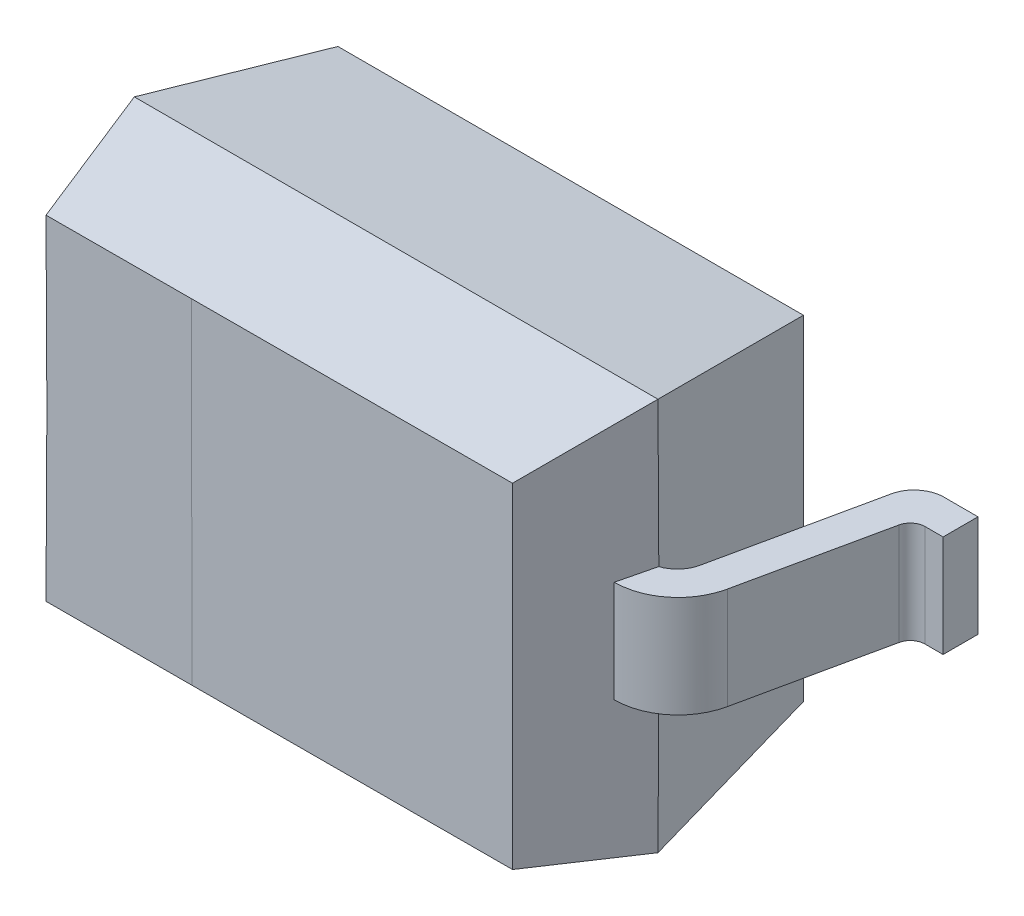
ISO-10303-21;
HEADER;
FILE_DESCRIPTION(('STEP AP214'),'2;1');
FILE_NAME('part.step','',(''),(''),'','','');
FILE_SCHEMA(('AUTOMOTIVE_DESIGN { 1 0 10303 214 1 1 1 1 }'));
ENDSEC;
DATA;
#1=APPLICATION_CONTEXT('core data for automotive mechanical design processes');
#2=APPLICATION_PROTOCOL_DEFINITION('international standard','automotive_design',2000,#1);
#3=PRODUCT_CONTEXT('',#1,'mechanical');
#4=PRODUCT('Part','Part','',(#3));
#5=PRODUCT_RELATED_PRODUCT_CATEGORY('part','',(#4));
#6=PRODUCT_DEFINITION_FORMATION('','',#4);
#7=PRODUCT_DEFINITION_CONTEXT('part definition',#1,'design');
#8=PRODUCT_DEFINITION('design','',#6,#7);
#9=PRODUCT_DEFINITION_SHAPE('','',#8);
#10=(LENGTH_UNIT() NAMED_UNIT(*) SI_UNIT(.MILLI.,.METRE.));
#11=(NAMED_UNIT(*) PLANE_ANGLE_UNIT() SI_UNIT($,.RADIAN.));
#12=(NAMED_UNIT(*) SI_UNIT($,.STERADIAN.) SOLID_ANGLE_UNIT());
#13=UNCERTAINTY_MEASURE_WITH_UNIT(LENGTH_MEASURE(1.E-05),#10,'distance_accuracy_value','');
#14=(GEOMETRIC_REPRESENTATION_CONTEXT(3) GLOBAL_UNCERTAINTY_ASSIGNED_CONTEXT((#13)) GLOBAL_UNIT_ASSIGNED_CONTEXT((#10,
#11,#12)) REPRESENTATION_CONTEXT('',''));
#15=CARTESIAN_POINT('',(0.,0.,0.));
#16=DIRECTION('',(0.,0.,1.));
#17=DIRECTION('',(1.,0.,0.));
#18=AXIS2_PLACEMENT_3D('',#15,#16,#17);
#19=CARTESIAN_POINT('',(0.,-0.543243243288,-0.09054054054794));
#20=DIRECTION('',(0.,0.986393923832198,0.164398987305033));
#21=DIRECTION('',(0.,-0.164398987305033,0.986393923832198));
#22=AXIS2_PLACEMENT_3D('',#19,#20,#21);
#23=PLANE('',#22);
#24=DIRECTION('',(1.,0.,0.));
#25=VECTOR('',#24,1.);
#26=CARTESIAN_POINT('',(0.,-0.575000000044785,0.0999999999931558));
#27=LINE('',#26,#25);
#28=CARTESIAN_POINT('',(0.799999999997001,-0.575000000043201,0.0999999999954373));
#29=VERTEX_POINT('',#28);
#30=CARTESIAN_POINT('',(-0.799999999994415,-0.575000000044785,0.0999999999954372));
#31=VERTEX_POINT('',#30);
#32=EDGE_CURVE('E193',#29,#31,#27,.F.);
#33=ORIENTED_EDGE('',*,*,#32,.F.);
#34=DIRECTION('',(-0.162221421362343,0.162221421124184,-0.973328526747075));
#35=VECTOR('',#34,1.);
#36=CARTESIAN_POINT('',(0.900000000150001,-0.675000000050974,0.700000000031505));
#37=LINE('',#36,#35);
#38=CARTESIAN_POINT('',(0.900000000166889,-0.675000000035166,0.700000000057759));
#39=VERTEX_POINT('',#38);
#40=EDGE_CURVE('E197',#39,#29,#37,.T.);
#41=ORIENTED_EDGE('',*,*,#40,.F.);
#42=DIRECTION('',(1.,0.,0.));
#43=VECTOR('',#42,1.);
#44=CARTESIAN_POINT('',(0.,-0.67500000002677,0.700000000024942));
#45=LINE('',#44,#43);
#46=CARTESIAN_POINT('',(-0.900000000179509,-0.675000000033264,0.700000000059395));
#47=VERTEX_POINT('',#46);
#48=EDGE_CURVE('E643',#47,#39,#45,.T.);
#49=ORIENTED_EDGE('',*,*,#48,.F.);
#50=DIRECTION('',(-0.162221421284221,-0.162221421126295,0.973328526759743));
#51=VECTOR('',#50,1.);
#52=CARTESIAN_POINT('',(-0.799999999997,-0.575000000045163,0.0999999999954261));
#53=LINE('',#52,#51);
#54=EDGE_CURVE('E200',#31,#47,#53,.T.);
#55=ORIENTED_EDGE('',*,*,#54,.F.);
#56=EDGE_LOOP('',(#33,#41,#49,#55));
#57=FACE_BOUND('',#56,.T.);
#58=ADVANCED_FACE('F17',(#57),#23,.F.);
#59=CARTESIAN_POINT('',(-1.180841579,-0.175,0.1));
#60=DIRECTION('',(0.,1.,0.));
#61=DIRECTION('',(0.,0.,1.));
#62=AXIS2_PLACEMENT_3D('',#59,#60,#61);
#63=CYLINDRICAL_SURFACE('',#62,0.09999999960066);
#64=CARTESIAN_POINT('',(-1.083061337682,0.175,0.0790470910838));
#65=CARTESIAN_POINT('',(-1.09079720693642,0.175,0.0456237214059379));
#66=CARTESIAN_POINT('',(-1.11851638773063,0.175,0.0229045349440198));
#67=CARTESIAN_POINT('',(-1.14576175106184,0.175,0.000573698605809601));
#68=CARTESIAN_POINT('',(-1.180841579,0.175,1.996683119407E-10));
#69=B_SPLINE_CURVE_WITH_KNOTS('',2,(#64,#65,#66,#67,#68),.UNSPECIFIED.,.F.,.F.,(3,2,3),(0.,0.5,
1.),.UNSPECIFIED.);
#70=CARTESIAN_POINT('',(-1.08306133762272,0.175,0.0790470910710971));
#71=VERTEX_POINT('',#70);
#72=CARTESIAN_POINT('',(-1.180841579,0.175,1.99669155585524E-10));
#73=VERTEX_POINT('',#72);
#74=EDGE_CURVE('E1234',#71,#73,#69,.T.);
#75=ORIENTED_EDGE('',*,*,#74,.F.);
#76=DIRECTION('',(0.,1.,0.));
#77=VECTOR('',#76,1.);
#78=CARTESIAN_POINT('',(-1.08306133713137,0.,0.0790470909658082));
#79=LINE('',#78,#77);
#80=CARTESIAN_POINT('',(-1.08306133762222,-0.175,0.0790470910710521));
#81=VERTEX_POINT('',#80);
#82=EDGE_CURVE('E645',#71,#81,#79,.F.);
#83=ORIENTED_EDGE('',*,*,#82,.T.);
#84=CARTESIAN_POINT('',(-1.180841579,-0.175,0.1));
#85=DIRECTION('',(0.,1.,0.));
#86=DIRECTION('',(0.977802413949683,0.,-0.209529089326932));
#87=AXIS2_PLACEMENT_3D('',#84,#85,#86);
#88=CIRCLE('',#87,0.09999999960066);
#89=CARTESIAN_POINT('',(-1.180841579,-0.175,1.99473895856474E-10));
#90=VERTEX_POINT('',#89);
#91=EDGE_CURVE('E761',#81,#90,#88,.T.);
#92=ORIENTED_EDGE('',*,*,#91,.T.);
#93=DIRECTION('',(0.,1.,0.));
#94=VECTOR('',#93,1.);
#95=CARTESIAN_POINT('',(-1.180841579,0.,0.));
#96=LINE('',#95,#94);
#97=EDGE_CURVE('E223',#73,#90,#96,.F.);
#98=ORIENTED_EDGE('',*,*,#97,.F.);
#99=EDGE_LOOP('',(#75,#83,#92,#98));
#100=FACE_BOUND('',#99,.T.);
#101=ADVANCED_FACE('F652',(#100),#63,.T.);
#102=CARTESIAN_POINT('',(0.,0.,0.));
#103=DIRECTION('',(0.,0.,-1.));
#104=DIRECTION('',(-1.,0.,0.));
#105=AXIS2_PLACEMENT_3D('',#102,#103,#104);
#106=PLANE('',#105);
#107=DIRECTION('',(1.,0.,0.));
#108=VECTOR('',#107,1.);
#109=CARTESIAN_POINT('',(0.,0.175,1.996683119407E-10));
#110=LINE('',#109,#108);
#111=CARTESIAN_POINT('',(-1.3,0.175,1.33112207960467E-10));
#112=VERTEX_POINT('',#111);
#113=EDGE_CURVE('E755',#73,#112,#110,.F.);
#114=ORIENTED_EDGE('',*,*,#113,.F.);
#115=ORIENTED_EDGE('',*,*,#97,.T.);
#116=DIRECTION('',(1.,0.,0.));
#117=VECTOR('',#116,1.);
#118=CARTESIAN_POINT('',(0.,-0.175,1.992777924826E-10));
#119=LINE('',#118,#117);
#120=CARTESIAN_POINT('',(-1.3,-0.175,1.32851861655067E-10));
#121=VERTEX_POINT('',#120);
#122=EDGE_CURVE('E742',#90,#121,#119,.F.);
#123=ORIENTED_EDGE('',*,*,#122,.T.);
#124=DIRECTION('',(0.,1.,0.));
#125=VECTOR('',#124,1.);
#126=CARTESIAN_POINT('',(-1.3,0.,0.));
#127=LINE('',#126,#125);
#128=EDGE_CURVE('E735',#121,#112,#127,.T.);
#129=ORIENTED_EDGE('',*,*,#128,.T.);
#130=EDGE_LOOP('',(#114,#115,#123,#129));
#131=FACE_BOUND('',#130,.T.);
#132=ADVANCED_FACE('F661',(#131),#106,.T.);
#133=CARTESIAN_POINT('',(-1.3,0.,0.));
#134=DIRECTION('',(1.,0.,0.));
#135=DIRECTION('',(0.,0.,-1.));
#136=AXIS2_PLACEMENT_3D('',#133,#134,#135);
#137=PLANE('',#136);
#138=DIRECTION('',(0.,1.,0.));
#139=VECTOR('',#138,1.);
#140=CARTESIAN_POINT('',(-1.3,0.,0.12));
#141=LINE('',#140,#139);
#142=CARTESIAN_POINT('',(-1.3,0.175,0.12));
#143=VERTEX_POINT('',#142);
#144=CARTESIAN_POINT('',(-1.3,-0.175,0.12));
#145=VERTEX_POINT('',#144);
#146=EDGE_CURVE('E731',#143,#145,#141,.F.);
#147=ORIENTED_EDGE('',*,*,#146,.F.);
#148=DIRECTION('',(0.,0.,1.));
#149=VECTOR('',#148,1.);
#150=CARTESIAN_POINT('',(-1.3,0.175,0.));
#151=LINE('',#150,#149);
#152=EDGE_CURVE('E703',#112,#143,#151,.T.);
#153=ORIENTED_EDGE('',*,*,#152,.F.);
#154=ORIENTED_EDGE('',*,*,#128,.F.);
#155=DIRECTION('',(0.,0.,1.));
#156=VECTOR('',#155,1.);
#157=CARTESIAN_POINT('',(-1.3,-0.175,0.));
#158=LINE('',#157,#156);
#159=EDGE_CURVE('E738',#121,#145,#158,.T.);
#160=ORIENTED_EDGE('',*,*,#159,.T.);
#161=EDGE_LOOP('',(#147,#153,#154,#160));
#162=FACE_BOUND('',#161,.T.);
#163=ADVANCED_FACE('F1170',(#162),#137,.F.);
#164=CARTESIAN_POINT('',(0.,0.,0.12));
#165=DIRECTION('',(0.,0.,1.));
#166=DIRECTION('',(1.,0.,0.));
#167=AXIS2_PLACEMENT_3D('',#164,#165,#166);
#168=PLANE('',#167);
#169=DIRECTION('',(1.,0.,0.));
#170=VECTOR('',#169,1.);
#171=CARTESIAN_POINT('',(0.,0.175,0.12));
#172=LINE('',#171,#170);
#173=CARTESIAN_POINT('',(-1.2374306839995,0.175,0.12000000043495));
#174=VERTEX_POINT('',#173);
#175=EDGE_CURVE('E1226',#143,#174,#172,.T.);
#176=ORIENTED_EDGE('',*,*,#175,.F.);
#177=ORIENTED_EDGE('',*,*,#146,.T.);
#178=DIRECTION('',(1.,0.,0.));
#179=VECTOR('',#178,1.);
#180=CARTESIAN_POINT('',(0.,-0.175,0.12));
#181=LINE('',#180,#179);
#182=CARTESIAN_POINT('',(-1.237430684,-0.175,0.12000000043495));
#183=VERTEX_POINT('',#182);
#184=EDGE_CURVE('E741',#145,#183,#181,.T.);
#185=ORIENTED_EDGE('',*,*,#184,.T.);
#186=DIRECTION('',(0.,1.,0.));
#187=VECTOR('',#186,1.);
#188=CARTESIAN_POINT('',(-1.237430684,-0.175,0.1200000006959));
#189=LINE('',#188,#187);
#190=EDGE_CURVE('E723',#183,#174,#189,.T.);
#191=ORIENTED_EDGE('',*,*,#190,.T.);
#192=EDGE_LOOP('',(#176,#177,#185,#191));
#193=FACE_BOUND('',#192,.T.);
#194=ADVANCED_FACE('F714',(#193),#168,.T.);
#195=CARTESIAN_POINT('',(-1.237430684,-0.175,0.17));
#196=DIRECTION('',(0.,1.,0.));
#197=DIRECTION('',(0.,0.,1.));
#198=AXIS2_PLACEMENT_3D('',#195,#196,#197);
#199=CYLINDRICAL_SURFACE('',#198,0.0499999993041);
#200=DIRECTION('',(0.,1.,0.));
#201=VECTOR('',#200,1.);
#202=CARTESIAN_POINT('',(-1.18854056314317,0.,0.159523545445109));
#203=LINE('',#202,#201);
#204=CARTESIAN_POINT('',(-1.18854056369632,0.175,0.15952354556364));
#205=VERTEX_POINT('',#204);
#206=CARTESIAN_POINT('',(-1.18854056369632,-0.175,0.15952354556314));
#207=VERTEX_POINT('',#206);
#208=EDGE_CURVE('E591',#205,#207,#203,.F.);
#209=ORIENTED_EDGE('',*,*,#208,.F.);
#210=CARTESIAN_POINT('',(-1.237430683999,0.175,0.120000000174));
#211=CARTESIAN_POINT('',(-1.22046761095307,0.175,0.120203477151064));
#212=CARTESIAN_POINT('',(-1.20626808869837,0.175,0.131452267780125));
#213=CARTESIAN_POINT('',(-1.19242017377317,0.175,0.142422516838411));
#214=CARTESIAN_POINT('',(-1.188540563824,0.175,0.159523545591));
#215=B_SPLINE_CURVE_WITH_KNOTS('',2,(#210,#211,#212,#213,#214),.UNSPECIFIED.,.F.,.F.,(3,2,3),
(0.,0.5,1.),.UNSPECIFIED.);
#216=EDGE_CURVE('E698',#174,#205,#215,.T.);
#217=ORIENTED_EDGE('',*,*,#216,.F.);
#218=ORIENTED_EDGE('',*,*,#190,.F.);
#219=CARTESIAN_POINT('',(-1.237430684,-0.175,0.17));
#220=DIRECTION('',(0.,-1.,0.));
#221=DIRECTION('',(0.,0.,-1.));
#222=AXIS2_PLACEMENT_3D('',#219,#220,#221);
#223=CIRCLE('',#222,0.0499999993041);
#224=EDGE_CURVE('E1248',#183,#207,#223,.T.);
#225=ORIENTED_EDGE('',*,*,#224,.T.);
#226=EDGE_LOOP('',(#209,#217,#218,#225));
#227=FACE_BOUND('',#226,.T.);
#228=ADVANCED_FACE('F704',(#227),#199,.F.);
#229=CARTESIAN_POINT('',(-1.169043606279,0.,0.25050934416));
#230=DIRECTION('',(-0.977802414084683,0.,0.209529088696932));
#231=DIRECTION('',(0.209529088696932,0.,0.977802414084683));
#232=AXIS2_PLACEMENT_3D('',#229,#230,#231);
#233=PLANE('',#232);
#234=DIRECTION('',(0.209529089205446,0.,0.977802413975715));
#235=VECTOR('',#234,1.);
#236=CARTESIAN_POINT('',(-1.188540563824,0.175,0.159523545591));
#237=LINE('',#236,#235);
#238=CARTESIAN_POINT('',(-1.08427495201213,0.175,0.646096399502456));
#239=VERTEX_POINT('',#238);
#240=EDGE_CURVE('E1224',#205,#239,#237,.T.);
#241=ORIENTED_EDGE('',*,*,#240,.F.);
#242=ORIENTED_EDGE('',*,*,#208,.T.);
#243=DIRECTION('',(0.209529089201603,0.,0.977802413976539));
#244=VECTOR('',#243,1.);
#245=CARTESIAN_POINT('',(-1.188540563824,-0.175,0.15952354559));
#246=LINE('',#245,#244);
#247=CARTESIAN_POINT('',(-1.08427495201313,-0.175,0.646096399501956));
#248=VERTEX_POINT('',#247);
#249=EDGE_CURVE('E1247',#207,#248,#246,.T.);
#250=ORIENTED_EDGE('',*,*,#249,.T.);
#251=DIRECTION('',(0.,1.,0.));
#252=VECTOR('',#251,1.);
#253=CARTESIAN_POINT('',(-1.08427495200026,-0.175,0.646096399499912));
#254=LINE('',#253,#252);
#255=EDGE_CURVE('E767',#239,#248,#254,.F.);
#256=ORIENTED_EDGE('',*,*,#255,.F.);
#257=EDGE_LOOP('',(#241,#242,#250,#256));
#258=FACE_BOUND('',#257,.T.);
#259=ADVANCED_FACE('F713',(#258),#233,.T.);
#260=CARTESIAN_POINT('',(1.169043606279,0.,0.25050934416));
#261=DIRECTION('',(-0.977802414084683,0.,-0.209529088696932));
#262=DIRECTION('',(-0.209529088696932,0.,0.977802414084683));
#263=AXIS2_PLACEMENT_3D('',#260,#261,#262);
#264=PLANE('',#263);
#265=DIRECTION('',(0.,1.,0.));
#266=VECTOR('',#265,1.);
#267=CARTESIAN_POINT('',(1.18854056331369,-0.175,0.159523545481505));
#268=LINE('',#267,#266);
#269=CARTESIAN_POINT('',(1.18854056339885,-0.175,0.159523545499753));
#270=VERTEX_POINT('',#269);
#271=CARTESIAN_POINT('',(1.18854056339885,0.175,0.159523545499253));
#272=VERTEX_POINT('',#271);
#273=EDGE_CURVE('E582',#270,#272,#268,.T.);
#274=ORIENTED_EDGE('',*,*,#273,.T.);
#275=DIRECTION('',(0.209529088421949,0.,-0.977802414143607));
#276=VECTOR('',#275,1.);
#277=CARTESIAN_POINT('',(1.084274952074,0.175,0.646096399514));
#278=LINE('',#277,#276);
#279=CARTESIAN_POINT('',(1.08427495208558,0.175,0.646096399517089));
#280=VERTEX_POINT('',#279);
#281=EDGE_CURVE('E407',#280,#272,#278,.T.);
#282=ORIENTED_EDGE('',*,*,#281,.F.);
#283=DIRECTION('',(0.,1.,0.));
#284=VECTOR('',#283,1.);
#285=CARTESIAN_POINT('',(1.08427495209716,-0.175,0.646096399520177));
#286=LINE('',#285,#284);
#287=CARTESIAN_POINT('',(1.08427495208508,-0.175,0.646096399517589));
#288=VERTEX_POINT('',#287);
#289=EDGE_CURVE('E409',#288,#280,#286,.T.);
#290=ORIENTED_EDGE('',*,*,#289,.F.);
#291=DIRECTION('',(0.20952908842387,0.,-0.977802414143196));
#292=VECTOR('',#291,1.);
#293=CARTESIAN_POINT('',(1.084274952073,-0.175,0.646096399515));
#294=LINE('',#293,#292);
#295=EDGE_CURVE('E503',#288,#270,#294,.T.);
#296=ORIENTED_EDGE('',*,*,#295,.T.);
#297=EDGE_LOOP('',(#274,#282,#290,#296));
#298=FACE_BOUND('',#297,.T.);
#299=ADVANCED_FACE('F572',(#298),#264,.F.);
#300=CARTESIAN_POINT('',(1.237430684,-0.175,0.17));
#301=DIRECTION('',(0.,1.,0.));
#302=DIRECTION('',(0.,0.,1.));
#303=AXIS2_PLACEMENT_3D('',#300,#301,#302);
#304=CYLINDRICAL_SURFACE('',#303,0.05);
#305=DIRECTION('',(0.,1.,0.));
#306=VECTOR('',#305,1.);
#307=CARTESIAN_POINT('',(1.237430684,0.,0.12));
#308=LINE('',#307,#306);
#309=CARTESIAN_POINT('',(1.237430684,0.175,0.12));
#310=VERTEX_POINT('',#309);
#311=CARTESIAN_POINT('',(1.2374306839995,-0.175,0.12));
#312=VERTEX_POINT('',#311);
#313=EDGE_CURVE('E590',#310,#312,#308,.F.);
#314=ORIENTED_EDGE('',*,*,#313,.F.);
#315=CARTESIAN_POINT('',(1.188540563484,0.175,0.159523545517));
#316=CARTESIAN_POINT('',(1.19229378058117,0.175,0.14297964578789));
#317=CARTESIAN_POINT('',(1.20626808830763,0.175,0.131452267317875));
#318=CARTESIAN_POINT('',(1.21989636538786,0.175,0.120210328835246));
#319=CARTESIAN_POINT('',(1.237430684,0.175,0.12));
#320=B_SPLINE_CURVE_WITH_KNOTS('',2,(#315,#316,#317,#318,#319),.UNSPECIFIED.,.F.,.F.,(3,2,3),
(0.,0.5,1.),.UNSPECIFIED.);
#321=EDGE_CURVE('E404',#272,#310,#320,.T.);
#322=ORIENTED_EDGE('',*,*,#321,.F.);
#323=ORIENTED_EDGE('',*,*,#273,.F.);
#324=CARTESIAN_POINT('',(1.237430684,-0.175,0.17));
#325=DIRECTION('',(0.,-1.,0.));
#326=DIRECTION('',(-0.97780241372619,0.,-0.209529090369899));
#327=AXIS2_PLACEMENT_3D('',#324,#325,#326);
#328=CIRCLE('',#327,0.05);
#329=EDGE_CURVE('E554',#270,#312,#328,.T.);
#330=ORIENTED_EDGE('',*,*,#329,.T.);
#331=EDGE_LOOP('',(#314,#322,#323,#330));
#332=FACE_BOUND('',#331,.T.);
#333=ADVANCED_FACE('F561',(#332),#304,.F.);
#334=CARTESIAN_POINT('',(0.,0.,0.12));
#335=DIRECTION('',(0.,0.,1.));
#336=DIRECTION('',(1.,0.,0.));
#337=AXIS2_PLACEMENT_3D('',#334,#335,#336);
#338=PLANE('',#337);
#339=DIRECTION('',(1.,0.,0.));
#340=VECTOR('',#339,1.);
#341=CARTESIAN_POINT('',(0.,0.175,0.12));
#342=LINE('',#341,#340);
#343=CARTESIAN_POINT('',(1.3,0.175,0.12));
#344=VERTEX_POINT('',#343);
#345=EDGE_CURVE('E402',#310,#344,#342,.T.);
#346=ORIENTED_EDGE('',*,*,#345,.F.);
#347=ORIENTED_EDGE('',*,*,#313,.T.);
#348=DIRECTION('',(1.,0.,0.));
#349=VECTOR('',#348,1.);
#350=CARTESIAN_POINT('',(0.,-0.175,0.12));
#351=LINE('',#350,#349);
#352=CARTESIAN_POINT('',(1.3,-0.175,0.12));
#353=VERTEX_POINT('',#352);
#354=EDGE_CURVE('E546',#312,#353,#351,.T.);
#355=ORIENTED_EDGE('',*,*,#354,.T.);
#356=DIRECTION('',(0.,1.,0.));
#357=VECTOR('',#356,1.);
#358=CARTESIAN_POINT('',(1.3,0.,0.12));
#359=LINE('',#358,#357);
#360=EDGE_CURVE('E615',#344,#353,#359,.F.);
#361=ORIENTED_EDGE('',*,*,#360,.F.);
#362=EDGE_LOOP('',(#346,#347,#355,#361));
#363=FACE_BOUND('',#362,.T.);
#364=ADVANCED_FACE('F571',(#363),#338,.T.);
#365=CARTESIAN_POINT('',(1.3,0.,0.));
#366=DIRECTION('',(1.,0.,0.));
#367=DIRECTION('',(0.,0.,-1.));
#368=AXIS2_PLACEMENT_3D('',#365,#366,#367);
#369=PLANE('',#368);
#370=DIRECTION('',(0.,0.,1.));
#371=VECTOR('',#370,1.);
#372=CARTESIAN_POINT('',(1.3,0.175,0.));
#373=LINE('',#372,#371);
#374=CARTESIAN_POINT('',(1.3,0.175,0.));
#375=VERTEX_POINT('',#374);
#376=EDGE_CURVE('E399',#344,#375,#373,.F.);
#377=ORIENTED_EDGE('',*,*,#376,.F.);
#378=ORIENTED_EDGE('',*,*,#360,.T.);
#379=DIRECTION('',(0.,0.,1.));
#380=VECTOR('',#379,1.);
#381=CARTESIAN_POINT('',(1.3,-0.175,0.));
#382=LINE('',#381,#380);
#383=CARTESIAN_POINT('',(1.3,-0.175,0.));
#384=VERTEX_POINT('',#383);
#385=EDGE_CURVE('E537',#353,#384,#382,.F.);
#386=ORIENTED_EDGE('',*,*,#385,.T.);
#387=DIRECTION('',(0.,1.,0.));
#388=VECTOR('',#387,1.);
#389=CARTESIAN_POINT('',(1.3,0.,0.));
#390=LINE('',#389,#388);
#391=EDGE_CURVE('E620',#375,#384,#390,.F.);
#392=ORIENTED_EDGE('',*,*,#391,.F.);
#393=EDGE_LOOP('',(#377,#378,#386,#392));
#394=FACE_BOUND('',#393,.T.);
#395=ADVANCED_FACE('F623',(#394),#369,.T.);
#396=CARTESIAN_POINT('',(0.,0.,0.));
#397=DIRECTION('',(0.,0.,-1.));
#398=DIRECTION('',(-1.,0.,0.));
#399=AXIS2_PLACEMENT_3D('',#396,#397,#398);
#400=PLANE('',#399);
#401=DIRECTION('',(1.,0.,0.));
#402=VECTOR('',#401,1.);
#403=CARTESIAN_POINT('',(0.,0.175,0.));
#404=LINE('',#403,#402);
#405=CARTESIAN_POINT('',(1.180841579,0.175,-1.9525972906695E-13));
#406=VERTEX_POINT('',#405);
#407=EDGE_CURVE('E390',#375,#406,#404,.F.);
#408=ORIENTED_EDGE('',*,*,#407,.F.);
#409=ORIENTED_EDGE('',*,*,#391,.T.);
#410=DIRECTION('',(1.,0.,0.));
#411=VECTOR('',#410,1.);
#412=CARTESIAN_POINT('',(0.,-0.175,0.));
#413=LINE('',#412,#411);
#414=CARTESIAN_POINT('',(1.180841579,-0.175,0.));
#415=VERTEX_POINT('',#414);
#416=EDGE_CURVE('E545',#384,#415,#413,.F.);
#417=ORIENTED_EDGE('',*,*,#416,.T.);
#418=DIRECTION('',(0.,1.,0.));
#419=VECTOR('',#418,1.);
#420=CARTESIAN_POINT('',(1.180841579,-0.175,0.));
#421=LINE('',#420,#419);
#422=EDGE_CURVE('E515',#406,#415,#421,.F.);
#423=ORIENTED_EDGE('',*,*,#422,.F.);
#424=EDGE_LOOP('',(#408,#409,#417,#423));
#425=FACE_BOUND('',#424,.T.);
#426=ADVANCED_FACE('F527',(#425),#400,.T.);
#427=CARTESIAN_POINT('',(1.180841579,-0.175,0.1));
#428=DIRECTION('',(0.,1.,0.));
#429=DIRECTION('',(0.,0.,1.));
#430=AXIS2_PLACEMENT_3D('',#427,#428,#429);
#431=CYLINDRICAL_SURFACE('',#430,0.1);
#432=CARTESIAN_POINT('',(1.180841579,0.175,-3.905194581339E-13));
#433=CARTESIAN_POINT('',(1.14653923769483,0.175,0.000560983177299556));
#434=CARTESIAN_POINT('',(1.1185163875185,0.175,0.0229045346688924));
#435=CARTESIAN_POINT('',(1.09097254558457,0.175,0.0448661569398064));
#436=CARTESIAN_POINT('',(1.083061337584,0.175,0.0790470910628));
#437=B_SPLINE_CURVE_WITH_KNOTS('',2,(#432,#433,#434,#435,#436),.UNSPECIFIED.,.F.,.F.,(3,2,3),
(0.,0.5,1.),.UNSPECIFIED.);
#438=CARTESIAN_POINT('',(1.0830613374761,0.175,0.0790470910396979));
#439=VERTEX_POINT('',#438);
#440=EDGE_CURVE('E385',#406,#439,#437,.T.);
#441=ORIENTED_EDGE('',*,*,#440,.F.);
#442=ORIENTED_EDGE('',*,*,#422,.T.);
#443=CARTESIAN_POINT('',(1.180841579,-0.175,0.1));
#444=DIRECTION('',(0.,1.,0.));
#445=DIRECTION('',(0.,0.,-1.));
#446=AXIS2_PLACEMENT_3D('',#443,#444,#445);
#447=CIRCLE('',#446,0.1);
#448=CARTESIAN_POINT('',(1.0830613374761,-0.175,0.0790470910397379));
#449=VERTEX_POINT('',#448);
#450=EDGE_CURVE('E1019',#415,#449,#447,.T.);
#451=ORIENTED_EDGE('',*,*,#450,.T.);
#452=DIRECTION('',(0.,1.,0.));
#453=VECTOR('',#452,1.);
#454=CARTESIAN_POINT('',(1.08306133713137,0.,0.0790470909658082));
#455=LINE('',#454,#453);
#456=EDGE_CURVE('E501',#439,#449,#455,.F.);
#457=ORIENTED_EDGE('',*,*,#456,.F.);
#458=EDGE_LOOP('',(#441,#442,#451,#457));
#459=FACE_BOUND('',#458,.T.);
#460=ADVANCED_FACE('F517',(#459),#431,.T.);
#461=CARTESIAN_POINT('',(0.,-0.800000000024,0.199999999985));
#462=DIRECTION('',(0.,-0.970142500151155,0.242535625013039));
#463=DIRECTION('',(0.,-0.242535625013039,-0.970142500151155));
#464=AXIS2_PLACEMENT_3D('',#461,#462,#463);
#465=PLANE('',#464);
#466=ORIENTED_EDGE('',*,*,#48,.T.);
#467=DIRECTION('',(-0.235702260744224,0.235702260352366,0.942809041505674));
#468=VECTOR('',#467,1.);
#469=CARTESIAN_POINT('',(0.90000000015,-0.675000000025182,0.700000000031295));
#470=LINE('',#469,#468);
#471=CARTESIAN_POINT('',(0.800000000305195,-0.57500000004204,1.10000000002734));
#472=VERTEX_POINT('',#471);
#473=EDGE_CURVE('E644',#39,#472,#470,.T.);
#474=ORIENTED_EDGE('',*,*,#473,.T.);
#475=CARTESIAN_POINT('',(0.800000000406927,-0.57500000004308,1.10000000000052));
#476=DIRECTION('',(-1.,0.,0.));
#477=VECTOR('',#476,1.);
#478=LINE('',#475,#477);
#479=CARTESIAN_POINT('',(-0.299999999999828,-0.574973397833718,1.10243444286112));
#480=VERTEX_POINT('',#479);
#481=EDGE_CURVE('E367',#472,#480,#478,.T.);
#482=ORIENTED_EDGE('',*,*,#481,.T.);
#483=CARTESIAN_POINT('',(-0.299999999996206,-0.574411764746722,1.1023529411862));
#484=DIRECTION('',(-1.,0.,0.));
#485=VECTOR('',#484,1.);
#486=LINE('',#483,#485);
#487=CARTESIAN_POINT('',(-0.799842843870536,-0.57477086065434,1.10360309864864));
#488=VERTEX_POINT('',#487);
#489=EDGE_CURVE('E638',#480,#488,#486,.T.);
#490=ORIENTED_EDGE('',*,*,#489,.T.);
#491=CARTESIAN_POINT('',(-0.800000000071977,-0.574411764746722,1.1023529411862));
#492=DIRECTION('',(-0.234399827595484,-0.235778650014057,-0.943114600152471));
#493=VECTOR('',#492,1.);
#494=LINE('',#491,#493);
#495=EDGE_CURVE('E230',#488,#47,#494,.T.);
#496=ORIENTED_EDGE('',*,*,#495,.T.);
#497=EDGE_LOOP('',(#466,#474,#482,#490,#496));
#498=FACE_BOUND('',#497,.T.);
#499=ADVANCED_FACE('F526',(#498),#465,.T.);
#500=CARTESIAN_POINT('',(-1.05170731659,0.,0.225365853517));
#501=DIRECTION('',(-0.977802414084683,0.,0.209529088696932));
#502=DIRECTION('',(0.209529088696932,0.,0.977802414084683));
#503=AXIS2_PLACEMENT_3D('',#500,#501,#502);
#504=PLANE('',#503);
#505=ORIENTED_EDGE('',*,*,#82,.F.);
#506=DIRECTION('',(-0.209529088790194,0.,-0.977802414064698));
#507=VECTOR('',#506,1.);
#508=CARTESIAN_POINT('',(-0.966938662403,0.175,0.620952908892));
#509=LINE('',#508,#507);
#510=CARTESIAN_POINT('',(-0.966938662402385,0.175,0.620952908891868));
#511=VERTEX_POINT('',#510);
#512=EDGE_CURVE('E355',#511,#71,#509,.T.);
#513=ORIENTED_EDGE('',*,*,#512,.F.);
#514=DIRECTION('',(0.,1.,0.));
#515=VECTOR('',#514,1.);
#516=CARTESIAN_POINT('',(-0.966938662401771,-0.175,0.620952908891737));
#517=LINE('',#516,#515);
#518=CARTESIAN_POINT('',(-0.966938662401885,-0.175,0.620952908892868));
#519=VERTEX_POINT('',#518);
#520=EDGE_CURVE('E362',#511,#519,#517,.F.);
#521=ORIENTED_EDGE('',*,*,#520,.T.);
#522=DIRECTION('',(-0.209529088789422,0.,-0.977802414064863));
#523=VECTOR('',#522,1.);
#524=CARTESIAN_POINT('',(-0.966938662402,-0.175,0.620952908894));
#525=LINE('',#524,#523);
#526=EDGE_CURVE('E766',#519,#81,#525,.T.);
#527=ORIENTED_EDGE('',*,*,#526,.T.);
#528=EDGE_LOOP('',(#505,#513,#521,#527));
#529=FACE_BOUND('',#528,.T.);
#530=ADVANCED_FACE('F323',(#529),#504,.F.);
#531=CARTESIAN_POINT('',(0.,0.175,0.));
#532=DIRECTION('',(0.,1.,0.));
#533=DIRECTION('',(0.,0.,1.));
#534=AXIS2_PLACEMENT_3D('',#531,#532,#533);
#535=PLANE('',#534);
#536=CARTESIAN_POINT('',(-0.900521806075806,0.175,0.697912777385182));
#537=DIRECTION('',(0.242535625013039,0.,0.970142500151155));
#538=VECTOR('',#537,1.);
#539=LINE('',#536,#538);
#540=CARTESIAN_POINT('',(-0.899622812819136,0.175000157030397,0.69674379656384));
#541=VERTEX_POINT('',#540);
#542=CARTESIAN_POINT('',(-0.86975032764811,0.175,0.820112952108237));
#543=VERTEX_POINT('',#542);
#544=EDGE_CURVE('E304',#541,#543,#539,.T.);
#545=ORIENTED_EDGE('',*,*,#544,.F.);
#546=CARTESIAN_POINT('',(-0.899614317743,0.175,0.697685905259));
#547=CARTESIAN_POINT('',(-0.954516229665046,0.175,0.675661964112867));
#548=CARTESIAN_POINT('',(-0.966938662403,0.175,0.620952908892));
#549=B_SPLINE_CURVE_WITH_KNOTS('',2,(#546,#547,#548),.UNSPECIFIED.,.F.,.F.,(3,3),(0.,1.),.UNSPECIFIED.);
#550=EDGE_CURVE('E354',#541,#511,#549,.T.);
#551=ORIENTED_EDGE('',*,*,#550,.T.);
#552=ORIENTED_EDGE('',*,*,#512,.T.);
#553=ORIENTED_EDGE('',*,*,#74,.T.);
#554=ORIENTED_EDGE('',*,*,#113,.T.);
#555=ORIENTED_EDGE('',*,*,#152,.T.);
#556=ORIENTED_EDGE('',*,*,#175,.T.);
#557=ORIENTED_EDGE('',*,*,#216,.T.);
#558=ORIENTED_EDGE('',*,*,#240,.T.);
#559=CARTESIAN_POINT('',(-0.869158421,0.175,0.6));
#560=DIRECTION('',(0.,-1.,0.));
#561=DIRECTION('',(-0.00179935719890421,0.,0.999998381155525));
#562=AXIS2_PLACEMENT_3D('',#559,#560,#561);
#563=CIRCLE('',#562,0.219999999901);
#564=EDGE_CURVE('E684',#543,#239,#563,.T.);
#565=ORIENTED_EDGE('',*,*,#564,.F.);
#566=EDGE_LOOP('',(#545,#551,#552,#553,#554,#555,#556,#557,#558,#565));
#567=FACE_BOUND('',#566,.T.);
#568=ADVANCED_FACE('F312',(#567),#535,.T.);
#569=CARTESIAN_POINT('',(-0.869158421,-0.175,0.6));
#570=DIRECTION('',(0.,1.,0.));
#571=DIRECTION('',(0.,0.,1.));
#572=AXIS2_PLACEMENT_3D('',#569,#570,#571);
#573=CYLINDRICAL_SURFACE('',#572,0.219999999901);
#574=ORIENTED_EDGE('',*,*,#564,.T.);
#575=ORIENTED_EDGE('',*,*,#255,.T.);
#576=CARTESIAN_POINT('',(-0.869158421,-0.175,0.6));
#577=DIRECTION('',(0.,1.,0.));
#578=DIRECTION('',(-0.977802414077543,0.,0.209529088730252));
#579=AXIS2_PLACEMENT_3D('',#576,#577,#578);
#580=CIRCLE('',#579,0.219999999901);
#581=CARTESIAN_POINT('',(-0.869750327648229,-0.175,0.820112952108317));
#582=VERTEX_POINT('',#581);
#583=EDGE_CURVE('E504',#248,#582,#580,.T.);
#584=ORIENTED_EDGE('',*,*,#583,.T.);
#585=CARTESIAN_POINT('',(-0.869950495760976,0.175,0.820198018656984));
#586=DIRECTION('',(0.,-1.,0.));
#587=VECTOR('',#586,1.);
#588=LINE('',#585,#587);
#589=EDGE_CURVE('E779',#543,#582,#588,.T.);
#590=ORIENTED_EDGE('',*,*,#589,.F.);
#591=EDGE_LOOP('',(#574,#575,#584,#590));
#592=FACE_BOUND('',#591,.T.);
#593=ADVANCED_FACE('F322',(#592),#573,.T.);
#594=CARTESIAN_POINT('',(0.,-0.175,0.));
#595=DIRECTION('',(0.,1.,0.));
#596=DIRECTION('',(0.,0.,1.));
#597=AXIS2_PLACEMENT_3D('',#594,#595,#596);
#598=PLANE('',#597);
#599=ORIENTED_EDGE('',*,*,#249,.F.);
#600=ORIENTED_EDGE('',*,*,#224,.F.);
#601=ORIENTED_EDGE('',*,*,#184,.F.);
#602=ORIENTED_EDGE('',*,*,#159,.F.);
#603=ORIENTED_EDGE('',*,*,#122,.F.);
#604=ORIENTED_EDGE('',*,*,#91,.F.);
#605=ORIENTED_EDGE('',*,*,#526,.F.);
#606=CARTESIAN_POINT('',(-0.966938662402,-0.175,0.620952908894));
#607=CARTESIAN_POINT('',(-0.954516229665414,-0.175,0.675661964112595));
#608=CARTESIAN_POINT('',(-0.899614317741,-0.175,0.69768590526));
#609=B_SPLINE_CURVE_WITH_KNOTS('',2,(#606,#607,#608),.UNSPECIFIED.,.F.,.F.,(3,3),(0.,1.),.UNSPECIFIED.);
#610=CARTESIAN_POINT('',(-0.899622813015203,-0.175000000002152,0.696743795961426));
#611=VERTEX_POINT('',#610);
#612=EDGE_CURVE('E365',#519,#611,#609,.T.);
#613=ORIENTED_EDGE('',*,*,#612,.T.);
#614=CARTESIAN_POINT('',(-0.869950495760976,-0.175,0.820198018656984));
#615=DIRECTION('',(-0.242535625013039,0.,-0.970142500151155));
#616=VECTOR('',#615,1.);
#617=LINE('',#614,#616);
#618=EDGE_CURVE('E776',#582,#611,#617,.T.);
#619=ORIENTED_EDGE('',*,*,#618,.F.);
#620=ORIENTED_EDGE('',*,*,#583,.F.);
#621=EDGE_LOOP('',(#599,#600,#601,#602,#603,#604,#605,#613,#619,#620));
#622=FACE_BOUND('',#621,.T.);
#623=ADVANCED_FACE('F760',(#622),#598,.F.);
#624=CARTESIAN_POINT('',(1.05170731659,0.,0.225365853517));
#625=DIRECTION('',(-0.977802414084683,0.,-0.209529088696932));
#626=DIRECTION('',(-0.209529088696932,0.,0.977802414084683));
#627=AXIS2_PLACEMENT_3D('',#624,#625,#626);
#628=PLANE('',#627);
#629=DIRECTION('',(-0.209529088634067,0.,0.977802414098154));
#630=VECTOR('',#629,1.);
#631=CARTESIAN_POINT('',(1.083061337584,0.175,0.0790470910628));
#632=LINE('',#631,#630);
#633=CARTESIAN_POINT('',(0.966938662385033,0.175,0.620952908889721));
#634=VERTEX_POINT('',#633);
#635=EDGE_CURVE('E379',#439,#634,#632,.T.);
#636=ORIENTED_EDGE('',*,*,#635,.F.);
#637=ORIENTED_EDGE('',*,*,#456,.T.);
#638=DIRECTION('',(-0.209529088634836,0.,0.977802414097989));
#639=VECTOR('',#638,1.);
#640=CARTESIAN_POINT('',(1.083061337584,-0.175,0.07904709106288));
#641=LINE('',#640,#639);
#642=CARTESIAN_POINT('',(0.966938662385033,-0.175,0.620952908888721));
#643=VERTEX_POINT('',#642);
#644=EDGE_CURVE('E604',#449,#643,#641,.T.);
#645=ORIENTED_EDGE('',*,*,#644,.T.);
#646=DIRECTION('',(0.,1.,0.));
#647=VECTOR('',#646,1.);
#648=CARTESIAN_POINT('',(0.966938662379067,-0.175,0.620952908887443));
#649=LINE('',#648,#647);
#650=EDGE_CURVE('E979',#643,#634,#649,.T.);
#651=ORIENTED_EDGE('',*,*,#650,.T.);
#652=EDGE_LOOP('',(#636,#637,#645,#651));
#653=FACE_BOUND('',#652,.T.);
#654=ADVANCED_FACE('F1060',(#653),#628,.T.);
#655=CARTESIAN_POINT('',(0.,-0.175,0.));
#656=DIRECTION('',(0.,1.,0.));
#657=DIRECTION('',(0.,0.,1.));
#658=AXIS2_PLACEMENT_3D('',#655,#656,#657);
#659=PLANE('',#658);
#660=ORIENTED_EDGE('',*,*,#644,.F.);
#661=ORIENTED_EDGE('',*,*,#450,.F.);
#662=ORIENTED_EDGE('',*,*,#416,.F.);
#663=ORIENTED_EDGE('',*,*,#385,.F.);
#664=ORIENTED_EDGE('',*,*,#354,.F.);
#665=ORIENTED_EDGE('',*,*,#329,.F.);
#666=ORIENTED_EDGE('',*,*,#295,.F.);
#667=CARTESIAN_POINT('',(0.869158421,-0.175,0.6));
#668=DIRECTION('',(0.,1.,0.));
#669=DIRECTION('',(0.00179935719863414,0.,0.999998381155525));
#670=AXIS2_PLACEMENT_3D('',#667,#668,#669);
#671=CIRCLE('',#670,0.22);
#672=CARTESIAN_POINT('',(0.86975032764674,-0.175,0.820112952165675));
#673=VERTEX_POINT('',#672);
#674=EDGE_CURVE('E498',#673,#288,#671,.T.);
#675=ORIENTED_EDGE('',*,*,#674,.F.);
#676=CARTESIAN_POINT('',(0.900521806076559,-0.175,0.697912777382173));
#677=DIRECTION('',(-0.242535625013039,0.,0.970142500151155));
#678=VECTOR('',#677,1.);
#679=LINE('',#676,#678);
#680=CARTESIAN_POINT('',(0.899622812815354,-0.175000157008987,0.696743796550896));
#681=VERTEX_POINT('',#680);
#682=EDGE_CURVE('E1000',#681,#673,#679,.T.);
#683=ORIENTED_EDGE('',*,*,#682,.F.);
#684=CARTESIAN_POINT('',(0.899614317741,-0.175,0.697685905256));
#685=CARTESIAN_POINT('',(0.954516229641669,-0.175,0.675661964084056));
#686=CARTESIAN_POINT('',(0.966938662391,-0.175,0.62095290889));
#687=B_SPLINE_CURVE_WITH_KNOTS('',2,(#684,#685,#686),.UNSPECIFIED.,.F.,.F.,(3,3),(0.,1.),.UNSPECIFIED.);
#688=EDGE_CURVE('E976',#681,#643,#687,.T.);
#689=ORIENTED_EDGE('',*,*,#688,.T.);
#690=EDGE_LOOP('',(#660,#661,#662,#663,#664,#665,#666,#675,#683,#689));
#691=FACE_BOUND('',#690,.T.);
#692=ADVANCED_FACE('F478',(#691),#659,.F.);
#693=CARTESIAN_POINT('',(0.869158421,-0.175,0.6));
#694=DIRECTION('',(0.,1.,0.));
#695=DIRECTION('',(0.,0.,1.));
#696=AXIS2_PLACEMENT_3D('',#693,#694,#695);
#697=CYLINDRICAL_SURFACE('',#696,0.22);
#698=CARTESIAN_POINT('',(0.869554458378,0.175,0.820099009345));
#699=CARTESIAN_POINT('',(0.948440348473844,0.175,0.81884202163516));
#700=CARTESIAN_POINT('',(1.007467480916,0.175,0.77108653935));
#701=CARTESIAN_POINT('',(1.06659235582358,0.175,0.723251979217366));
#702=CARTESIAN_POINT('',(1.084274952074,0.175,0.646096399514));
#703=B_SPLINE_CURVE_WITH_KNOTS('',2,(#698,#699,#700,#701,#702),.UNSPECIFIED.,.F.,.F.,(3,2,3),
(0.,0.5,1.),.UNSPECIFIED.);
#704=CARTESIAN_POINT('',(0.869750327646859,0.175,0.820112952165755));
#705=VERTEX_POINT('',#704);
#706=EDGE_CURVE('E374',#705,#280,#703,.T.);
#707=ORIENTED_EDGE('',*,*,#706,.F.);
#708=CARTESIAN_POINT('',(0.869950495753211,-0.175,0.820198018688043));
#709=DIRECTION('',(0.,1.,0.));
#710=VECTOR('',#709,1.);
#711=LINE('',#708,#710);
#712=EDGE_CURVE('E461',#673,#705,#711,.T.);
#713=ORIENTED_EDGE('',*,*,#712,.F.);
#714=ORIENTED_EDGE('',*,*,#674,.T.);
#715=ORIENTED_EDGE('',*,*,#289,.T.);
#716=EDGE_LOOP('',(#707,#713,#714,#715));
#717=FACE_BOUND('',#716,.T.);
#718=ADVANCED_FACE('F468',(#717),#697,.T.);
#719=CARTESIAN_POINT('',(0.,0.175,0.));
#720=DIRECTION('',(0.,1.,0.));
#721=DIRECTION('',(0.,0.,1.));
#722=AXIS2_PLACEMENT_3D('',#719,#720,#721);
#723=PLANE('',#722);
#724=CARTESIAN_POINT('',(0.869950495753211,0.175,0.820198018688043));
#725=DIRECTION('',(0.242535625013039,0.,-0.970142500151155));
#726=VECTOR('',#725,1.);
#727=LINE('',#724,#726);
#728=CARTESIAN_POINT('',(0.899622813011527,0.175000000002941,0.696743795948219));
#729=VERTEX_POINT('',#728);
#730=EDGE_CURVE('E415',#705,#729,#727,.T.);
#731=ORIENTED_EDGE('',*,*,#730,.F.);
#732=ORIENTED_EDGE('',*,*,#706,.T.);
#733=ORIENTED_EDGE('',*,*,#281,.T.);
#734=ORIENTED_EDGE('',*,*,#321,.T.);
#735=ORIENTED_EDGE('',*,*,#345,.T.);
#736=ORIENTED_EDGE('',*,*,#376,.T.);
#737=ORIENTED_EDGE('',*,*,#407,.T.);
#738=ORIENTED_EDGE('',*,*,#440,.T.);
#739=ORIENTED_EDGE('',*,*,#635,.T.);
#740=CARTESIAN_POINT('',(0.966938662391,0.175,0.620952908892));
#741=CARTESIAN_POINT('',(0.954516229641325,0.175,0.675661964084447));
#742=CARTESIAN_POINT('',(0.89961431774,0.175,0.697685905256));
#743=B_SPLINE_CURVE_WITH_KNOTS('',2,(#740,#741,#742),.UNSPECIFIED.,.F.,.F.,(3,3),(0.,1.),.UNSPECIFIED.);
#744=EDGE_CURVE('E982',#634,#729,#743,.T.);
#745=ORIENTED_EDGE('',*,*,#744,.T.);
#746=EDGE_LOOP('',(#731,#732,#733,#734,#735,#736,#737,#738,#739,#745));
#747=FACE_BOUND('',#746,.T.);
#748=ADVANCED_FACE('F477',(#747),#723,.T.);
#749=CARTESIAN_POINT('',(0.,0.,1.1));
#750=DIRECTION('',(0.,0.,-1.));
#751=DIRECTION('',(-1.,0.,0.));
#752=AXIS2_PLACEMENT_3D('',#749,#750,#751);
#753=PLANE('',#752);
#754=DIRECTION('',(0.,1.,0.));
#755=VECTOR('',#754,1.);
#756=CARTESIAN_POINT('',(0.800000000406927,0.,1.10000000010173));
#757=LINE('',#756,#755);
#758=CARTESIAN_POINT('',(0.800000000203732,0.575000000018084,1.10000000004652));
#759=VERTEX_POINT('',#758);
#760=EDGE_CURVE('E860',#759,#472,#757,.F.);
#761=ORIENTED_EDGE('',*,*,#760,.F.);
#762=CARTESIAN_POINT('',(0.800000000136,0.575000000007,1.1));
#763=DIRECTION('',(-1.,0.,0.));
#764=VECTOR('',#763,1.);
#765=LINE('',#762,#764);
#766=CARTESIAN_POINT('',(-0.3,0.574956125815636,1.10253411742267));
#767=VERTEX_POINT('',#766);
#768=EDGE_CURVE('E859',#759,#767,#765,.T.);
#769=ORIENTED_EDGE('',*,*,#768,.T.);
#770=CARTESIAN_POINT('',(-0.3,-0.575000000014,1.105));
#771=DIRECTION('',(0.,1.,0.));
#772=VECTOR('',#771,1.);
#773=LINE('',#770,#772);
#774=EDGE_CURVE('E363',#480,#767,#773,.T.);
#775=ORIENTED_EDGE('',*,*,#774,.F.);
#776=ORIENTED_EDGE('',*,*,#481,.F.);
#777=EDGE_LOOP('',(#761,#769,#775,#776));
#778=FACE_BOUND('',#777,.T.);
#779=ADVANCED_FACE('F882',(#778),#753,.F.);
#780=CARTESIAN_POINT('',(0.,0.,1.105));
#781=DIRECTION('',(0.,0.,1.));
#782=DIRECTION('',(1.,0.,0.));
#783=AXIS2_PLACEMENT_3D('',#780,#781,#782);
#784=PLANE('',#783);
#785=CARTESIAN_POINT('',(-0.799411765112156,-0.575000000014,1.10235294128105));
#786=CARTESIAN_POINT('',(-0.800293274082376,-2.91037810171146E-11,1.09882690539982));
#787=CARTESIAN_POINT('',(-0.799411765112392,0.575000000007,1.10235294128011));
#788=B_SPLINE_CURVE_WITH_KNOTS('',2,(#785,#786,#787),.UNSPECIFIED.,.F.,.F.,(3,3),(0.,1.),.UNSPECIFIED.);
#789=CARTESIAN_POINT('',(-0.799842843883149,0.574770860647138,1.10360309865157));
#790=VERTEX_POINT('',#789);
#791=EDGE_CURVE('E782',#488,#790,#788,.T.);
#792=ORIENTED_EDGE('',*,*,#791,.F.);
#793=ORIENTED_EDGE('',*,*,#489,.F.);
#794=ORIENTED_EDGE('',*,*,#774,.T.);
#795=CARTESIAN_POINT('',(-0.3,0.575000000007,1.105));
#796=DIRECTION('',(-1.,0.,0.));
#797=VECTOR('',#796,1.);
#798=LINE('',#795,#797);
#799=EDGE_CURVE('E843',#767,#790,#798,.T.);
#800=ORIENTED_EDGE('',*,*,#799,.T.);
#801=EDGE_LOOP('',(#792,#793,#794,#800));
#802=FACE_BOUND('',#801,.T.);
#803=ADVANCED_FACE('F890',(#802),#784,.T.);
#804=CARTESIAN_POINT('',(-0.869158421,-0.175,0.6));
#805=DIRECTION('',(0.,1.,0.));
#806=DIRECTION('',(0.,0.,1.));
#807=AXIS2_PLACEMENT_3D('',#804,#805,#806);
#808=CYLINDRICAL_SURFACE('',#807,0.09999999999807);
#809=ORIENTED_EDGE('',*,*,#520,.F.);
#810=ORIENTED_EDGE('',*,*,#550,.F.);
#811=CARTESIAN_POINT('',(-0.899614317538188,-0.175000000009023,0.697685905293802));
#812=DIRECTION('',(0.,1.,0.));
#813=VECTOR('',#812,1.);
#814=LINE('',#811,#813);
#815=EDGE_CURVE('E786',#611,#541,#814,.T.);
#816=ORIENTED_EDGE('',*,*,#815,.F.);
#817=ORIENTED_EDGE('',*,*,#612,.F.);
#818=EDGE_LOOP('',(#809,#810,#816,#817));
#819=FACE_BOUND('',#818,.T.);
#820=ADVANCED_FACE('F247',(#819),#808,.F.);
#821=CARTESIAN_POINT('',(-1.011764706275,0.,0.252941176543));
#822=DIRECTION('',(-0.970142500151155,0.,0.242535625013039));
#823=DIRECTION('',(0.242535625013039,0.,0.970142500151155));
#824=AXIS2_PLACEMENT_3D('',#821,#822,#823);
#825=PLANE('',#824);
#826=ORIENTED_EDGE('',*,*,#495,.F.);
#827=ORIENTED_EDGE('',*,*,#791,.T.);
#828=CARTESIAN_POINT('',(-0.799446367187,0.574411764738545,1.10221453298167));
#829=DIRECTION('',(-0.235697753683304,0.2357788609387,-0.942791014829423));
#830=VECTOR('',#829,1.);
#831=LINE('',#828,#830);
#832=CARTESIAN_POINT('',(-0.900000000254735,0.675000000029796,0.700000000089903));
#833=VERTEX_POINT('',#832);
#834=EDGE_CURVE('E788',#790,#833,#831,.T.);
#835=ORIENTED_EDGE('',*,*,#834,.T.);
#836=CARTESIAN_POINT('',(-0.899614318213069,0.175000875057379,0.697685909343085));
#837=DIRECTION('',(-0.000771356445001381,0.999988992610262,0.00462813867001782));
#838=VECTOR('',#837,1.);
#839=LINE('',#836,#838);
#840=EDGE_CURVE('E794',#541,#833,#839,.T.);
#841=ORIENTED_EDGE('',*,*,#840,.F.);
#842=ORIENTED_EDGE('',*,*,#544,.T.);
#843=ORIENTED_EDGE('',*,*,#589,.T.);
#844=ORIENTED_EDGE('',*,*,#618,.T.);
#845=CARTESIAN_POINT('',(-0.899999999996566,-0.675000000035,0.700000000044072));
#846=DIRECTION('',(0.000771356425987317,0.999988992610804,-0.00462813855593366));
#847=VECTOR('',#846,1.);
#848=LINE('',#845,#847);
#849=EDGE_CURVE('E778',#47,#611,#848,.T.);
#850=ORIENTED_EDGE('',*,*,#849,.F.);
#851=EDGE_LOOP('',(#826,#827,#835,#841,#842,#843,#844,#850));
#852=FACE_BOUND('',#851,.T.);
#853=ADVANCED_FACE('F236',(#852),#825,.T.);
#854=CARTESIAN_POINT('',(0.869158421,-0.175,0.6));
#855=DIRECTION('',(0.,1.,0.));
#856=DIRECTION('',(0.,0.,1.));
#857=AXIS2_PLACEMENT_3D('',#854,#855,#856);
#858=CYLINDRICAL_SURFACE('',#857,0.09999999997497);
#859=ORIENTED_EDGE('',*,*,#650,.F.);
#860=ORIENTED_EDGE('',*,*,#688,.F.);
#861=CARTESIAN_POINT('',(0.899614317537513,0.17500000001233,0.697685905289748));
#862=DIRECTION('',(0.,-1.,0.));
#863=VECTOR('',#862,1.);
#864=LINE('',#861,#863);
#865=EDGE_CURVE('E1387',#729,#681,#864,.T.);
#866=ORIENTED_EDGE('',*,*,#865,.F.);
#867=ORIENTED_EDGE('',*,*,#744,.F.);
#868=EDGE_LOOP('',(#859,#860,#866,#867));
#869=FACE_BOUND('',#868,.T.);
#870=ADVANCED_FACE('F246',(#869),#858,.F.);
#871=CARTESIAN_POINT('',(1.011764706275,0.,0.252941176543));
#872=DIRECTION('',(0.970142500151155,0.,0.242535625013039));
#873=DIRECTION('',(0.242535625013039,0.,-0.970142500151155));
#874=AXIS2_PLACEMENT_3D('',#871,#872,#873);
#875=PLANE('',#874);
#876=DIRECTION('',(-0.235702260572685,-0.235702260362456,0.942809041546036));
#877=VECTOR('',#876,1.);
#878=CARTESIAN_POINT('',(0.900000000203,0.675000000010476,0.700000000090119));
#879=LINE('',#878,#877);
#880=CARTESIAN_POINT('',(0.90000000021255,0.675000000036251,0.700000000114392));
#881=VERTEX_POINT('',#880);
#882=EDGE_CURVE('E847',#881,#759,#879,.T.);
#883=ORIENTED_EDGE('',*,*,#882,.T.);
#884=ORIENTED_EDGE('',*,*,#760,.T.);
#885=ORIENTED_EDGE('',*,*,#473,.F.);
#886=CARTESIAN_POINT('',(0.899614318212459,-0.175000874967607,0.697685909339426));
#887=DIRECTION('',(0.000771356432310171,-0.999988992610624,0.00462813859386926));
#888=VECTOR('',#887,1.);
#889=LINE('',#886,#888);
#890=EDGE_CURVE('E212',#681,#39,#889,.T.);
#891=ORIENTED_EDGE('',*,*,#890,.F.);
#892=ORIENTED_EDGE('',*,*,#682,.T.);
#893=ORIENTED_EDGE('',*,*,#712,.T.);
#894=ORIENTED_EDGE('',*,*,#730,.T.);
#895=CARTESIAN_POINT('',(0.900000000009765,0.675000000026298,0.700000000123265));
#896=DIRECTION('',(-0.000771356453748577,-0.999988992610012,-0.00462813872250143));
#897=VECTOR('',#896,1.);
#898=LINE('',#895,#897);
#899=EDGE_CURVE('E1390',#881,#729,#898,.T.);
#900=ORIENTED_EDGE('',*,*,#899,.F.);
#901=EDGE_LOOP('',(#883,#884,#885,#891,#892,#893,#894,#900));
#902=FACE_BOUND('',#901,.T.);
#903=ADVANCED_FACE('F421',(#902),#875,.T.);
#904=CARTESIAN_POINT('',(0.,0.800000000024,0.199999999985));
#905=DIRECTION('',(0.,-0.970142500151155,-0.242535625013039));
#906=DIRECTION('',(0.,0.242535625013039,-0.970142500151155));
#907=AXIS2_PLACEMENT_3D('',#904,#905,#906);
#908=PLANE('',#907);
#909=ORIENTED_EDGE('',*,*,#799,.F.);
#910=ORIENTED_EDGE('',*,*,#768,.F.);
#911=ORIENTED_EDGE('',*,*,#882,.F.);
#912=DIRECTION('',(1.,0.,0.));
#913=VECTOR('',#912,1.);
#914=CARTESIAN_POINT('',(0.,0.675000000053136,0.700000000044477));
#915=LINE('',#914,#913);
#916=EDGE_CURVE('E844',#833,#881,#915,.T.);
#917=ORIENTED_EDGE('',*,*,#916,.F.);
#918=ORIENTED_EDGE('',*,*,#834,.F.);
#919=EDGE_LOOP('',(#909,#910,#911,#917,#918));
#920=FACE_BOUND('',#919,.T.);
#921=ADVANCED_FACE('F430',(#920),#908,.F.);
#922=CARTESIAN_POINT('',(-0.762162162152,0.,-0.127027027025));
#923=DIRECTION('',(-0.986393923832198,0.,-0.164398987305033));
#924=DIRECTION('',(-0.164398987305033,0.,0.986393923832198));
#925=AXIS2_PLACEMENT_3D('',#922,#923,#924);
#926=PLANE('',#925);
#927=DIRECTION('',(-0.162221421600692,0.162221421117742,0.973328526708424));
#928=VECTOR('',#927,1.);
#929=CARTESIAN_POINT('',(-0.79999999999,0.575000000044847,0.0999999999935256));
#930=LINE('',#929,#928);
#931=CARTESIAN_POINT('',(-0.799999999989801,0.575000000011212,0.0999999999989147));
#932=VERTEX_POINT('',#931);
#933=EDGE_CURVE('E849',#932,#833,#930,.T.);
#934=ORIENTED_EDGE('',*,*,#933,.F.);
#935=DIRECTION('',(0.,1.,0.));
#936=VECTOR('',#935,1.);
#937=CARTESIAN_POINT('',(-0.79999999999,0.,0.1));
#938=LINE('',#937,#936);
#939=EDGE_CURVE('E207',#932,#31,#938,.F.);
#940=ORIENTED_EDGE('',*,*,#939,.T.);
#941=ORIENTED_EDGE('',*,*,#54,.T.);
#942=ORIENTED_EDGE('',*,*,#849,.T.);
#943=ORIENTED_EDGE('',*,*,#815,.T.);
#944=ORIENTED_EDGE('',*,*,#840,.T.);
#945=EDGE_LOOP('',(#934,#940,#941,#942,#943,#944));
#946=FACE_BOUND('',#945,.T.);
#947=ADVANCED_FACE('F785',(#946),#926,.T.);
#948=CARTESIAN_POINT('',(0.762162162152,0.,-0.127027027025));
#949=DIRECTION('',(0.986393923832198,0.,-0.164398987305033));
#950=DIRECTION('',(-0.164398987305033,0.,-0.986393923832198));
#951=AXIS2_PLACEMENT_3D('',#948,#949,#950);
#952=PLANE('',#951);
#953=ORIENTED_EDGE('',*,*,#40,.T.);
#954=DIRECTION('',(0.,1.,0.));
#955=VECTOR('',#954,1.);
#956=CARTESIAN_POINT('',(0.799999999997,0.,0.1));
#957=LINE('',#956,#955);
#958=CARTESIAN_POINT('',(0.799999999991959,0.57500000001083,0.099999999996865));
#959=VERTEX_POINT('',#958);
#960=EDGE_CURVE('E26',#29,#959,#957,.T.);
#961=ORIENTED_EDGE('',*,*,#960,.T.);
#962=DIRECTION('',(-0.162221421438812,-0.162221421122117,-0.973328526734674));
#963=VECTOR('',#962,1.);
#964=CARTESIAN_POINT('',(0.900000000203,0.675000000059622,0.700000000083396));
#965=LINE('',#964,#963);
#966=EDGE_CURVE('E34',#881,#959,#965,.T.);
#967=ORIENTED_EDGE('',*,*,#966,.F.);
#968=ORIENTED_EDGE('',*,*,#899,.T.);
#969=ORIENTED_EDGE('',*,*,#865,.T.);
#970=ORIENTED_EDGE('',*,*,#890,.T.);
#971=EDGE_LOOP('',(#953,#961,#967,#968,#969,#970));
#972=FACE_BOUND('',#971,.T.);
#973=ADVANCED_FACE('F209',(#972),#952,.T.);
#974=CARTESIAN_POINT('',(0.,0.543243243288,-0.09054054054794));
#975=DIRECTION('',(0.,0.986393923832198,-0.164398987305033));
#976=DIRECTION('',(0.,0.164398987305033,0.986393923832198));
#977=AXIS2_PLACEMENT_3D('',#974,#975,#976);
#978=PLANE('',#977);
#979=ORIENTED_EDGE('',*,*,#916,.T.);
#980=ORIENTED_EDGE('',*,*,#966,.T.);
#981=DIRECTION('',(1.,0.,0.));
#982=VECTOR('',#981,1.);
#983=CARTESIAN_POINT('',(0.,0.575,0.1));
#984=LINE('',#983,#982);
#985=EDGE_CURVE('E11',#959,#932,#984,.F.);
#986=ORIENTED_EDGE('',*,*,#985,.T.);
#987=ORIENTED_EDGE('',*,*,#933,.T.);
#988=EDGE_LOOP('',(#979,#980,#986,#987));
#989=FACE_BOUND('',#988,.T.);
#990=ADVANCED_FACE('F1066',(#989),#978,.T.);
#991=CARTESIAN_POINT('',(0.,0.,0.1));
#992=DIRECTION('',(0.,0.,1.));
#993=DIRECTION('',(1.,0.,0.));
#994=AXIS2_PLACEMENT_3D('',#991,#992,#993);
#995=PLANE('',#994);
#996=ORIENTED_EDGE('',*,*,#960,.F.);
#997=ORIENTED_EDGE('',*,*,#32,.T.);
#998=ORIENTED_EDGE('',*,*,#939,.F.);
#999=ORIENTED_EDGE('',*,*,#985,.F.);
#1000=EDGE_LOOP('',(#996,#997,#998,#999));
#1001=FACE_BOUND('',#1000,.T.);
#1002=ADVANCED_FACE('F205',(#1001),#995,.F.);
#1003=CLOSED_SHELL('',(#58,#101,#132,#163,#194,#228,#259,#299,#333,#364,#395,#426,#460,#499,
#530,#568,#593,#623,#654,#692,#718,#748,#779,#803,#820,#853,#870,#903,#921,#947,#973,#990,#1002));
#1004=MANIFOLD_SOLID_BREP('B1',#1003);
#1005=ADVANCED_BREP_SHAPE_REPRESENTATION('',(#18,#1004),#14);
#1006=SHAPE_DEFINITION_REPRESENTATION(#9,#1005);
ENDSEC;
END-ISO-10303-21;
